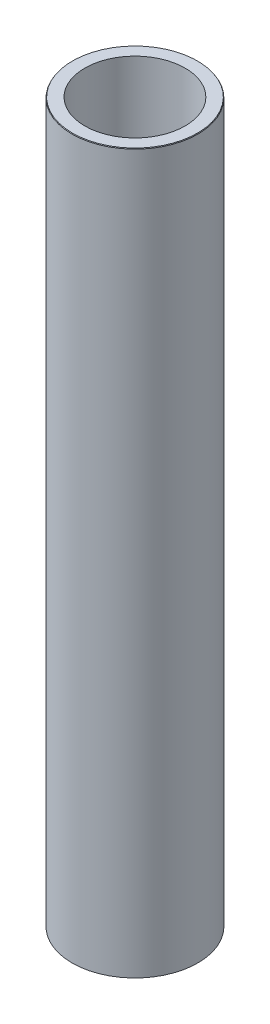
ISO-10303-21;
HEADER;
FILE_DESCRIPTION(('STEP AP214'),'2;1');
FILE_NAME('part.step','',(''),(''),'','','');
FILE_SCHEMA(('AUTOMOTIVE_DESIGN { 1 0 10303 214 1 1 1 1 }'));
ENDSEC;
DATA;
#1=APPLICATION_CONTEXT('core data for automotive mechanical design processes');
#2=APPLICATION_PROTOCOL_DEFINITION('international standard','automotive_design',2000,#1);
#3=PRODUCT_CONTEXT('',#1,'mechanical');
#4=PRODUCT('Part','Part','',(#3));
#5=PRODUCT_RELATED_PRODUCT_CATEGORY('part','',(#4));
#6=PRODUCT_DEFINITION_FORMATION('','',#4);
#7=PRODUCT_DEFINITION_CONTEXT('part definition',#1,'design');
#8=PRODUCT_DEFINITION('design','',#6,#7);
#9=PRODUCT_DEFINITION_SHAPE('','',#8);
#10=(LENGTH_UNIT() NAMED_UNIT(*) SI_UNIT(.MILLI.,.METRE.));
#11=(NAMED_UNIT(*) PLANE_ANGLE_UNIT() SI_UNIT($,.RADIAN.));
#12=(NAMED_UNIT(*) SI_UNIT($,.STERADIAN.) SOLID_ANGLE_UNIT());
#13=UNCERTAINTY_MEASURE_WITH_UNIT(LENGTH_MEASURE(1.E-05),#10,'distance_accuracy_value','');
#14=(GEOMETRIC_REPRESENTATION_CONTEXT(3) GLOBAL_UNCERTAINTY_ASSIGNED_CONTEXT((#13)) GLOBAL_UNIT_ASSIGNED_CONTEXT((#10,
#11,#12)) REPRESENTATION_CONTEXT('',''));
#15=CARTESIAN_POINT('',(0.,0.,0.));
#16=DIRECTION('',(0.,0.,1.));
#17=DIRECTION('',(1.,0.,0.));
#18=AXIS2_PLACEMENT_3D('',#15,#16,#17);
#19=CARTESIAN_POINT('',(0.,600.,0.));
#20=DIRECTION('',(0.,-1.,0.));
#21=DIRECTION('',(0.,0.,-1.));
#22=AXIS2_PLACEMENT_3D('',#19,#20,#21);
#23=CYLINDRICAL_SURFACE('',#22,52.5);
#24=CARTESIAN_POINT('',(0.,599.420810387378,0.));
#25=DIRECTION('',(0.,1.,0.));
#26=DIRECTION('',(0.,0.,1.));
#27=AXIS2_PLACEMENT_3D('',#24,#25,#26);
#28=CIRCLE('',#27,52.5);
#29=CARTESIAN_POINT('',(0.,599.420810387378,52.5));
#30=VERTEX_POINT('',#29);
#31=EDGE_CURVE('E50',#30,#30,#28,.F.);
#32=ORIENTED_EDGE('',*,*,#31,.T.);
#33=EDGE_LOOP('',(#32));
#34=FACE_BOUND('',#33,.T.);
#35=CARTESIAN_POINT('',(0.,0.334395278758781,0.));
#36=DIRECTION('',(0.,1.,0.));
#37=DIRECTION('',(0.,0.,1.));
#38=AXIS2_PLACEMENT_3D('',#35,#36,#37);
#39=CIRCLE('',#38,52.5);
#40=CARTESIAN_POINT('',(0.,0.334395278758781,52.5));
#41=VERTEX_POINT('',#40);
#42=EDGE_CURVE('E51',#41,#41,#39,.T.);
#43=ORIENTED_EDGE('',*,*,#42,.T.);
#44=EDGE_LOOP('',(#43));
#45=FACE_BOUND('',#44,.T.);
#46=ADVANCED_FACE('F39',(#34,#45),#23,.T.);
#47=CARTESIAN_POINT('',(0.,600.,0.));
#48=DIRECTION('',(0.,1.,0.));
#49=DIRECTION('',(0.,0.,1.));
#50=AXIS2_PLACEMENT_3D('',#47,#48,#49);
#51=PLANE('',#50);
#52=CARTESIAN_POINT('',(0.,600.,0.));
#53=DIRECTION('',(0.,1.,0.));
#54=DIRECTION('',(0.,0.,1.));
#55=AXIS2_PLACEMENT_3D('',#52,#53,#54);
#56=CIRCLE('',#55,52.165604721241);
#57=CARTESIAN_POINT('',(0.,600.,52.165604721241));
#58=VERTEX_POINT('',#57);
#59=EDGE_CURVE('E54',#58,#58,#56,.T.);
#60=ORIENTED_EDGE('',*,*,#59,.T.);
#61=EDGE_LOOP('',(#60));
#62=FACE_BOUND('',#61,.T.);
#63=CARTESIAN_POINT('',(0.,600.,0.));
#64=DIRECTION('',(0.,1.,0.));
#65=DIRECTION('',(0.,0.,1.));
#66=AXIS2_PLACEMENT_3D('',#63,#64,#65);
#67=CIRCLE('',#66,41.8644129905228);
#68=CARTESIAN_POINT('',(0.,600.,41.8644129905228));
#69=VERTEX_POINT('',#68);
#70=EDGE_CURVE('E58',#69,#69,#67,.T.);
#71=ORIENTED_EDGE('',*,*,#70,.F.);
#72=EDGE_LOOP('',(#71));
#73=FACE_BOUND('',#72,.T.);
#74=ADVANCED_FACE('F69',(#62,#73),#51,.T.);
#75=CARTESIAN_POINT('',(0.,0.,0.));
#76=DIRECTION('',(0.,1.,0.));
#77=DIRECTION('',(0.,0.,1.));
#78=AXIS2_PLACEMENT_3D('',#75,#76,#77);
#79=PLANE('',#78);
#80=CARTESIAN_POINT('',(0.,0.,0.));
#81=DIRECTION('',(0.,1.,0.));
#82=DIRECTION('',(0.,0.,1.));
#83=AXIS2_PLACEMENT_3D('',#80,#81,#82);
#84=CIRCLE('',#83,51.9208103873785);
#85=CARTESIAN_POINT('',(0.,0.,51.9208103873785));
#86=VERTEX_POINT('',#85);
#87=EDGE_CURVE('E10',#86,#86,#84,.F.);
#88=ORIENTED_EDGE('',*,*,#87,.T.);
#89=EDGE_LOOP('',(#88));
#90=FACE_BOUND('',#89,.T.);
#91=CARTESIAN_POINT('',(0.,0.,0.));
#92=DIRECTION('',(0.,1.,0.));
#93=DIRECTION('',(0.,0.,1.));
#94=AXIS2_PLACEMENT_3D('',#91,#92,#93);
#95=CIRCLE('',#94,41.8644129905228);
#96=CARTESIAN_POINT('',(0.,0.,41.8644129905228));
#97=VERTEX_POINT('',#96);
#98=EDGE_CURVE('E63',#97,#97,#95,.T.);
#99=ORIENTED_EDGE('',*,*,#98,.T.);
#100=EDGE_LOOP('',(#99));
#101=FACE_BOUND('',#100,.T.);
#102=ADVANCED_FACE('F75',(#90,#101),#79,.F.);
#103=CARTESIAN_POINT('',(0.,600.,0.));
#104=DIRECTION('',(0.,-1.,0.));
#105=DIRECTION('',(0.,0.,-1.));
#106=AXIS2_PLACEMENT_3D('',#103,#104,#105);
#107=CYLINDRICAL_SURFACE('',#106,41.8644129905228);
#108=ORIENTED_EDGE('',*,*,#70,.T.);
#109=EDGE_LOOP('',(#108));
#110=FACE_BOUND('',#109,.T.);
#111=ORIENTED_EDGE('',*,*,#98,.F.);
#112=EDGE_LOOP('',(#111));
#113=FACE_BOUND('',#112,.T.);
#114=ADVANCED_FACE('F70',(#110,#113),#107,.F.);
#115=CARTESIAN_POINT('',(0.,600.,0.));
#116=DIRECTION('',(0.,-1.,0.));
#117=DIRECTION('',(0.,0.,-1.));
#118=AXIS2_PLACEMENT_3D('',#115,#116,#117);
#119=CONICAL_SURFACE('',#118,52.165604721241,0.523598775598266);
#120=ORIENTED_EDGE('',*,*,#31,.F.);
#121=EDGE_LOOP('',(#120));
#122=FACE_BOUND('',#121,.T.);
#123=ORIENTED_EDGE('',*,*,#59,.F.);
#124=EDGE_LOOP('',(#123));
#125=FACE_BOUND('',#124,.T.);
#126=ADVANCED_FACE('F81',(#122,#125),#119,.T.);
#127=CARTESIAN_POINT('',(0.,0.334395278758781,0.));
#128=DIRECTION('',(0.,1.,0.));
#129=DIRECTION('',(0.,0.,1.));
#130=AXIS2_PLACEMENT_3D('',#127,#128,#129);
#131=CONICAL_SURFACE('',#130,52.5,1.04719755119669);
#132=ORIENTED_EDGE('',*,*,#87,.F.);
#133=EDGE_LOOP('',(#132));
#134=FACE_BOUND('',#133,.T.);
#135=ORIENTED_EDGE('',*,*,#42,.F.);
#136=EDGE_LOOP('',(#135));
#137=FACE_BOUND('',#136,.T.);
#138=ADVANCED_FACE('F45',(#134,#137),#131,.T.);
#139=CLOSED_SHELL('',(#46,#74,#102,#114,#126,#138));
#140=MANIFOLD_SOLID_BREP('B2',#139);
#141=ADVANCED_BREP_SHAPE_REPRESENTATION('',(#18,#140),#14);
#142=SHAPE_DEFINITION_REPRESENTATION(#9,#141);
ENDSEC;
END-ISO-10303-21;
